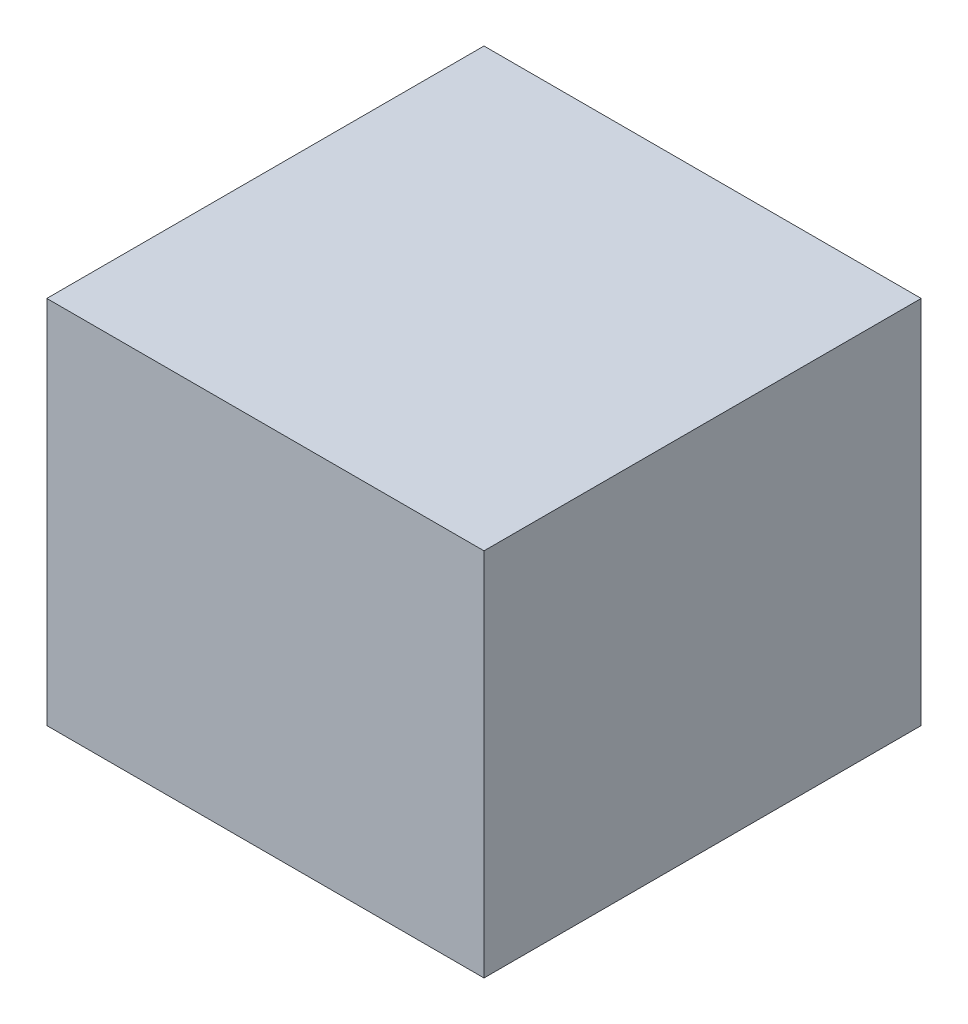
ISO-10303-21;
HEADER;
FILE_DESCRIPTION(('STEP AP214'),'2;1');
FILE_NAME('part.step','',(''),(''),'','','');
FILE_SCHEMA(('AUTOMOTIVE_DESIGN { 1 0 10303 214 1 1 1 1 }'));
ENDSEC;
DATA;
#1=APPLICATION_CONTEXT('core data for automotive mechanical design processes');
#2=APPLICATION_PROTOCOL_DEFINITION('international standard','automotive_design',2000,#1);
#3=PRODUCT_CONTEXT('',#1,'mechanical');
#4=PRODUCT('Part','Part','',(#3));
#5=PRODUCT_RELATED_PRODUCT_CATEGORY('part','',(#4));
#6=PRODUCT_DEFINITION_FORMATION('','',#4);
#7=PRODUCT_DEFINITION_CONTEXT('part definition',#1,'design');
#8=PRODUCT_DEFINITION('design','',#6,#7);
#9=PRODUCT_DEFINITION_SHAPE('','',#8);
#10=(LENGTH_UNIT() NAMED_UNIT(*) SI_UNIT(.MILLI.,.METRE.));
#11=(NAMED_UNIT(*) PLANE_ANGLE_UNIT() SI_UNIT($,.RADIAN.));
#12=(NAMED_UNIT(*) SI_UNIT($,.STERADIAN.) SOLID_ANGLE_UNIT());
#13=UNCERTAINTY_MEASURE_WITH_UNIT(LENGTH_MEASURE(1.E-05),#10,'distance_accuracy_value','');
#14=(GEOMETRIC_REPRESENTATION_CONTEXT(3) GLOBAL_UNCERTAINTY_ASSIGNED_CONTEXT((#13)) GLOBAL_UNIT_ASSIGNED_CONTEXT((#10,
#11,#12)) REPRESENTATION_CONTEXT('',''));
#15=CARTESIAN_POINT('',(0.,0.,0.));
#16=DIRECTION('',(0.,0.,1.));
#17=DIRECTION('',(1.,0.,0.));
#18=AXIS2_PLACEMENT_3D('',#15,#16,#17);
#19=CARTESIAN_POINT('',(165.1,279.4,-165.1));
#20=DIRECTION('',(-1.,0.,0.));
#21=DIRECTION('',(0.,0.,1.));
#22=AXIS2_PLACEMENT_3D('',#19,#20,#21);
#23=PLANE('',#22);
#24=DIRECTION('',(0.,0.,-1.));
#25=VECTOR('',#24,1.);
#26=CARTESIAN_POINT('',(165.1,0.,-165.1));
#27=LINE('',#26,#25);
#28=CARTESIAN_POINT('',(165.1,0.,165.1));
#29=VERTEX_POINT('',#28);
#30=CARTESIAN_POINT('',(165.1,0.,-165.1));
#31=VERTEX_POINT('',#30);
#32=EDGE_CURVE('E98',#29,#31,#27,.T.);
#33=ORIENTED_EDGE('',*,*,#32,.T.);
#34=DIRECTION('',(0.,-1.,0.));
#35=VECTOR('',#34,1.);
#36=CARTESIAN_POINT('',(165.1,279.4,-165.1));
#37=LINE('',#36,#35);
#38=CARTESIAN_POINT('',(165.1,279.4,-165.1));
#39=VERTEX_POINT('',#38);
#40=EDGE_CURVE('E11',#39,#31,#37,.T.);
#41=ORIENTED_EDGE('',*,*,#40,.F.);
#42=DIRECTION('',(0.,0.,-1.));
#43=VECTOR('',#42,1.);
#44=CARTESIAN_POINT('',(165.1,279.4,-165.1));
#45=LINE('',#44,#43);
#46=CARTESIAN_POINT('',(165.1,279.4,165.1));
#47=VERTEX_POINT('',#46);
#48=EDGE_CURVE('E86',#47,#39,#45,.T.);
#49=ORIENTED_EDGE('',*,*,#48,.F.);
#50=DIRECTION('',(0.,-1.,0.));
#51=VECTOR('',#50,1.);
#52=CARTESIAN_POINT('',(165.1,279.4,165.1));
#53=LINE('',#52,#51);
#54=EDGE_CURVE('E94',#47,#29,#53,.T.);
#55=ORIENTED_EDGE('',*,*,#54,.T.);
#56=EDGE_LOOP('',(#33,#41,#49,#55));
#57=FACE_BOUND('',#56,.T.);
#58=ADVANCED_FACE('F35',(#57),#23,.F.);
#59=CARTESIAN_POINT('',(-165.1,279.4,-165.1));
#60=DIRECTION('',(0.,0.,1.));
#61=DIRECTION('',(1.,0.,0.));
#62=AXIS2_PLACEMENT_3D('',#59,#60,#61);
#63=PLANE('',#62);
#64=DIRECTION('',(-1.,0.,0.));
#65=VECTOR('',#64,1.);
#66=CARTESIAN_POINT('',(-165.1,0.,-165.1));
#67=LINE('',#66,#65);
#68=CARTESIAN_POINT('',(-165.1,0.,-165.1));
#69=VERTEX_POINT('',#68);
#70=EDGE_CURVE('E90',#31,#69,#67,.T.);
#71=ORIENTED_EDGE('',*,*,#70,.T.);
#72=DIRECTION('',(0.,-1.,0.));
#73=VECTOR('',#72,1.);
#74=CARTESIAN_POINT('',(-165.1,279.4,-165.1));
#75=LINE('',#74,#73);
#76=CARTESIAN_POINT('',(-165.1,279.4,-165.1));
#77=VERTEX_POINT('',#76);
#78=EDGE_CURVE('E43',#77,#69,#75,.T.);
#79=ORIENTED_EDGE('',*,*,#78,.F.);
#80=DIRECTION('',(-1.,0.,0.));
#81=VECTOR('',#80,1.);
#82=CARTESIAN_POINT('',(-165.1,279.4,-165.1));
#83=LINE('',#82,#81);
#84=EDGE_CURVE('E81',#39,#77,#83,.T.);
#85=ORIENTED_EDGE('',*,*,#84,.F.);
#86=ORIENTED_EDGE('',*,*,#40,.T.);
#87=EDGE_LOOP('',(#71,#79,#85,#86));
#88=FACE_BOUND('',#87,.T.);
#89=ADVANCED_FACE('F89',(#88),#63,.F.);
#90=CARTESIAN_POINT('',(-165.1,279.4,-165.1));
#91=DIRECTION('',(1.,0.,0.));
#92=DIRECTION('',(0.,0.,-1.));
#93=AXIS2_PLACEMENT_3D('',#90,#91,#92);
#94=PLANE('',#93);
#95=DIRECTION('',(0.,0.,1.));
#96=VECTOR('',#95,1.);
#97=CARTESIAN_POINT('',(-165.1,0.,-165.1));
#98=LINE('',#97,#96);
#99=CARTESIAN_POINT('',(-165.1,0.,165.1));
#100=VERTEX_POINT('',#99);
#101=EDGE_CURVE('E68',#69,#100,#98,.T.);
#102=ORIENTED_EDGE('',*,*,#101,.T.);
#103=DIRECTION('',(0.,-1.,0.));
#104=VECTOR('',#103,1.);
#105=CARTESIAN_POINT('',(-165.1,279.4,165.1));
#106=LINE('',#105,#104);
#107=CARTESIAN_POINT('',(-165.1,279.4,165.1));
#108=VERTEX_POINT('',#107);
#109=EDGE_CURVE('E91',#108,#100,#106,.T.);
#110=ORIENTED_EDGE('',*,*,#109,.F.);
#111=DIRECTION('',(0.,0.,1.));
#112=VECTOR('',#111,1.);
#113=CARTESIAN_POINT('',(-165.1,279.4,-165.1));
#114=LINE('',#113,#112);
#115=EDGE_CURVE('E84',#77,#108,#114,.T.);
#116=ORIENTED_EDGE('',*,*,#115,.F.);
#117=ORIENTED_EDGE('',*,*,#78,.T.);
#118=EDGE_LOOP('',(#102,#110,#116,#117));
#119=FACE_BOUND('',#118,.T.);
#120=ADVANCED_FACE('F92',(#119),#94,.F.);
#121=CARTESIAN_POINT('',(-165.1,279.4,165.1));
#122=DIRECTION('',(0.,0.,-1.));
#123=DIRECTION('',(-1.,0.,0.));
#124=AXIS2_PLACEMENT_3D('',#121,#122,#123);
#125=PLANE('',#124);
#126=DIRECTION('',(1.,0.,0.));
#127=VECTOR('',#126,1.);
#128=CARTESIAN_POINT('',(-165.1,0.,165.1));
#129=LINE('',#128,#127);
#130=EDGE_CURVE('E74',#100,#29,#129,.T.);
#131=ORIENTED_EDGE('',*,*,#130,.T.);
#132=ORIENTED_EDGE('',*,*,#54,.F.);
#133=DIRECTION('',(1.,0.,0.));
#134=VECTOR('',#133,1.);
#135=CARTESIAN_POINT('',(-165.1,279.4,165.1));
#136=LINE('',#135,#134);
#137=EDGE_CURVE('E51',#108,#47,#136,.T.);
#138=ORIENTED_EDGE('',*,*,#137,.F.);
#139=ORIENTED_EDGE('',*,*,#109,.T.);
#140=EDGE_LOOP('',(#131,#132,#138,#139));
#141=FACE_BOUND('',#140,.T.);
#142=ADVANCED_FACE('F105',(#141),#125,.F.);
#143=CARTESIAN_POINT('',(0.,279.4,0.));
#144=DIRECTION('',(0.,1.,0.));
#145=DIRECTION('',(0.,0.,1.));
#146=AXIS2_PLACEMENT_3D('',#143,#144,#145);
#147=PLANE('',#146);
#148=ORIENTED_EDGE('',*,*,#48,.T.);
#149=ORIENTED_EDGE('',*,*,#84,.T.);
#150=ORIENTED_EDGE('',*,*,#115,.T.);
#151=ORIENTED_EDGE('',*,*,#137,.T.);
#152=EDGE_LOOP('',(#148,#149,#150,#151));
#153=FACE_BOUND('',#152,.T.);
#154=ADVANCED_FACE('F82',(#153),#147,.T.);
#155=CARTESIAN_POINT('',(0.,0.,0.));
#156=DIRECTION('',(0.,1.,0.));
#157=DIRECTION('',(0.,0.,1.));
#158=AXIS2_PLACEMENT_3D('',#155,#156,#157);
#159=PLANE('',#158);
#160=ORIENTED_EDGE('',*,*,#32,.F.);
#161=ORIENTED_EDGE('',*,*,#130,.F.);
#162=ORIENTED_EDGE('',*,*,#101,.F.);
#163=ORIENTED_EDGE('',*,*,#70,.F.);
#164=EDGE_LOOP('',(#160,#161,#162,#163));
#165=FACE_BOUND('',#164,.T.);
#166=ADVANCED_FACE('F108',(#165),#159,.F.);
#167=CLOSED_SHELL('',(#58,#89,#120,#142,#154,#166));
#168=MANIFOLD_SOLID_BREP('B2',#167);
#169=ADVANCED_BREP_SHAPE_REPRESENTATION('',(#18,#168),#14);
#170=SHAPE_DEFINITION_REPRESENTATION(#9,#169);
ENDSEC;
END-ISO-10303-21;
